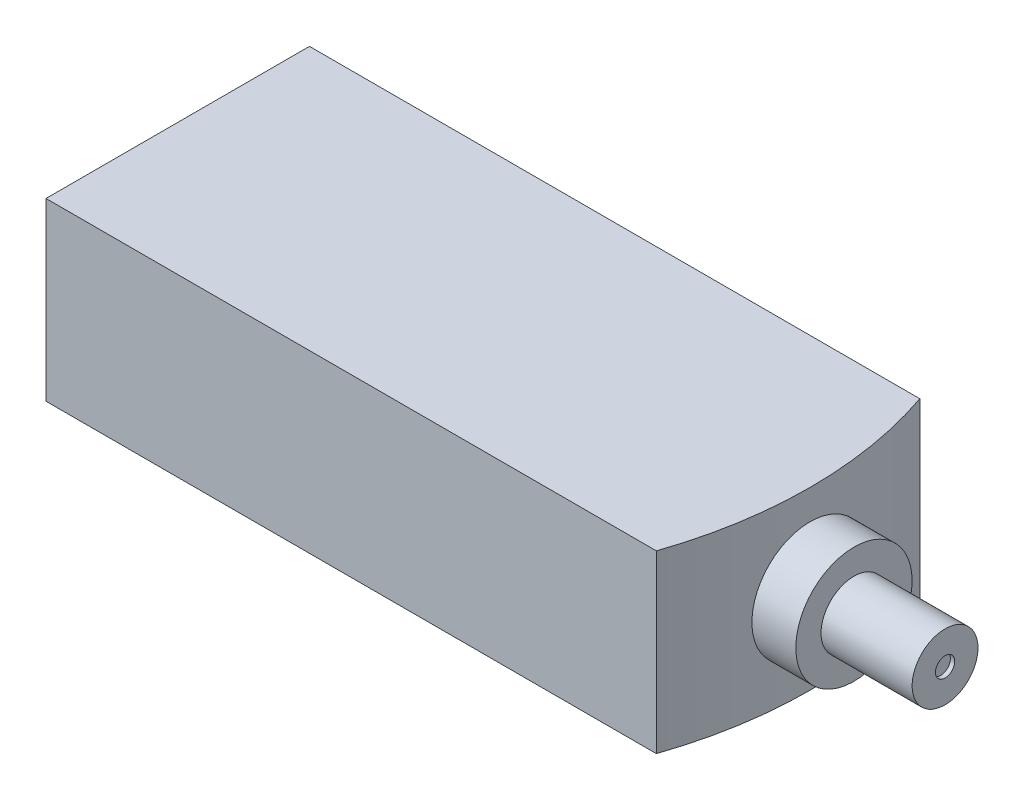
ISO-10303-21;
HEADER;
FILE_DESCRIPTION(('STEP AP214'),'2;1');
FILE_NAME('part.step','',(''),(''),'','','');
FILE_SCHEMA(('AUTOMOTIVE_DESIGN { 1 0 10303 214 1 1 1 1 }'));
ENDSEC;
DATA;
#1=APPLICATION_CONTEXT('core data for automotive mechanical design processes');
#2=APPLICATION_PROTOCOL_DEFINITION('international standard','automotive_design',2000,#1);
#3=PRODUCT_CONTEXT('',#1,'mechanical');
#4=PRODUCT('Part','Part','',(#3));
#5=PRODUCT_RELATED_PRODUCT_CATEGORY('part','',(#4));
#6=PRODUCT_DEFINITION_FORMATION('','',#4);
#7=PRODUCT_DEFINITION_CONTEXT('part definition',#1,'design');
#8=PRODUCT_DEFINITION('design','',#6,#7);
#9=PRODUCT_DEFINITION_SHAPE('','',#8);
#10=(LENGTH_UNIT() NAMED_UNIT(*) SI_UNIT(.MILLI.,.METRE.));
#11=(NAMED_UNIT(*) PLANE_ANGLE_UNIT() SI_UNIT($,.RADIAN.));
#12=(NAMED_UNIT(*) SI_UNIT($,.STERADIAN.) SOLID_ANGLE_UNIT());
#13=UNCERTAINTY_MEASURE_WITH_UNIT(LENGTH_MEASURE(1.E-05),#10,'distance_accuracy_value','');
#14=(GEOMETRIC_REPRESENTATION_CONTEXT(3) GLOBAL_UNCERTAINTY_ASSIGNED_CONTEXT((#13)) GLOBAL_UNIT_ASSIGNED_CONTEXT((#10,
#11,#12)) REPRESENTATION_CONTEXT('',''));
#15=CARTESIAN_POINT('',(0.,0.,0.));
#16=DIRECTION('',(0.,0.,1.));
#17=DIRECTION('',(1.,0.,0.));
#18=AXIS2_PLACEMENT_3D('',#15,#16,#17);
#19=CARTESIAN_POINT('',(53.664660841939,40.,-42.4281648318437));
#20=DIRECTION('',(-1.,0.,0.));
#21=DIRECTION('',(0.,0.,1.));
#22=AXIS2_PLACEMENT_3D('',#19,#20,#21);
#23=CYLINDRICAL_SURFACE('',#22,26.482881767622);
#24=CARTESIAN_POINT('',(53.664660841939,40.,-42.4281648318437));
#25=DIRECTION('',(1.,0.,0.));
#26=DIRECTION('',(0.,0.,-1.));
#27=AXIS2_PLACEMENT_3D('',#24,#25,#26);
#28=CIRCLE('',#27,26.482881767622);
#29=CARTESIAN_POINT('',(53.664660841939,40.,-68.9110465994657));
#30=VERTEX_POINT('',#29);
#31=EDGE_CURVE('E11',#30,#30,#28,.T.);
#32=ORIENTED_EDGE('',*,*,#31,.F.);
#33=EDGE_LOOP('',(#32));
#34=FACE_BOUND('',#33,.T.);
#35=CARTESIAN_POINT('',(33.6646608419389,40.,-42.4281648318437));
#36=DIRECTION('',(1.,0.,0.));
#37=DIRECTION('',(0.,0.,-1.));
#38=AXIS2_PLACEMENT_3D('',#35,#36,#37);
#39=CIRCLE('',#38,26.482881767622);
#40=CARTESIAN_POINT('',(33.6646608419389,40.,-68.9110465994657));
#41=VERTEX_POINT('',#40);
#42=EDGE_CURVE('E44',#41,#41,#39,.T.);
#43=ORIENTED_EDGE('',*,*,#42,.T.);
#44=EDGE_LOOP('',(#43));
#45=FACE_BOUND('',#44,.T.);
#46=ADVANCED_FACE('F41',(#34,#45),#23,.T.);
#47=CARTESIAN_POINT('',(53.664660841939,40.,-42.4281648318437));
#48=DIRECTION('',(1.,0.,0.));
#49=DIRECTION('',(0.,0.,-1.));
#50=AXIS2_PLACEMENT_3D('',#47,#48,#49);
#51=PLANE('',#50);
#52=CARTESIAN_POINT('',(53.664660841939,40.,-42.4281648318437));
#53=DIRECTION('',(1.,0.,0.));
#54=DIRECTION('',(0.,0.,-1.));
#55=AXIS2_PLACEMENT_3D('',#52,#53,#54);
#56=CIRCLE('',#55,15.);
#57=CARTESIAN_POINT('',(53.664660841939,40.,-57.4281648318437));
#58=VERTEX_POINT('',#57);
#59=EDGE_CURVE('E53',#58,#58,#56,.T.);
#60=ORIENTED_EDGE('',*,*,#59,.F.);
#61=EDGE_LOOP('',(#60));
#62=FACE_BOUND('',#61,.T.);
#63=ORIENTED_EDGE('',*,*,#31,.T.);
#64=EDGE_LOOP('',(#63));
#65=FACE_BOUND('',#64,.T.);
#66=ADVANCED_FACE('F86',(#62,#65),#51,.T.);
#67=CARTESIAN_POINT('',(33.6646608419389,40.,-42.4281648318437));
#68=DIRECTION('',(1.,0.,0.));
#69=DIRECTION('',(0.,0.,-1.));
#70=AXIS2_PLACEMENT_3D('',#67,#68,#69);
#71=PLANE('',#70);
#72=ORIENTED_EDGE('',*,*,#42,.F.);
#73=EDGE_LOOP('',(#72));
#74=FACE_BOUND('',#73,.T.);
#75=ADVANCED_FACE('F82',(#74),#71,.F.);
#76=CARTESIAN_POINT('',(95.164660841939,40.,-42.4281648318437));
#77=DIRECTION('',(-1.,0.,0.));
#78=DIRECTION('',(0.,0.,1.));
#79=AXIS2_PLACEMENT_3D('',#76,#77,#78);
#80=CYLINDRICAL_SURFACE('',#79,15.);
#81=CARTESIAN_POINT('',(95.164660841939,40.,-42.4281648318437));
#82=DIRECTION('',(1.,0.,0.));
#83=DIRECTION('',(0.,0.,-1.));
#84=AXIS2_PLACEMENT_3D('',#81,#82,#83);
#85=CIRCLE('',#84,15.);
#86=CARTESIAN_POINT('',(95.164660841939,40.,-57.4281648318437));
#87=VERTEX_POINT('',#86);
#88=EDGE_CURVE('E51',#87,#87,#85,.T.);
#89=ORIENTED_EDGE('',*,*,#88,.F.);
#90=EDGE_LOOP('',(#89));
#91=FACE_BOUND('',#90,.T.);
#92=ORIENTED_EDGE('',*,*,#59,.T.);
#93=EDGE_LOOP('',(#92));
#94=FACE_BOUND('',#93,.T.);
#95=ADVANCED_FACE('F76',(#91,#94),#80,.T.);
#96=CARTESIAN_POINT('',(95.164660841939,40.,-42.4281648318437));
#97=DIRECTION('',(1.,0.,0.));
#98=DIRECTION('',(0.,0.,-1.));
#99=AXIS2_PLACEMENT_3D('',#96,#97,#98);
#100=PLANE('',#99);
#101=CARTESIAN_POINT('',(95.164660841939,40.,-42.4281648318437));
#102=DIRECTION('',(1.,0.,0.));
#103=DIRECTION('',(0.,0.,-1.));
#104=AXIS2_PLACEMENT_3D('',#101,#102,#103);
#105=CIRCLE('',#104,4.40575071218853);
#106=CARTESIAN_POINT('',(95.164660841939,40.,-46.8339155440322));
#107=VERTEX_POINT('',#106);
#108=EDGE_CURVE('E59',#107,#107,#105,.T.);
#109=ORIENTED_EDGE('',*,*,#108,.F.);
#110=EDGE_LOOP('',(#109));
#111=FACE_BOUND('',#110,.T.);
#112=ORIENTED_EDGE('',*,*,#88,.T.);
#113=EDGE_LOOP('',(#112));
#114=FACE_BOUND('',#113,.T.);
#115=ADVANCED_FACE('F70',(#111,#114),#100,.T.);
#116=CARTESIAN_POINT('',(93.1646608419389,40.,-42.4281648318437));
#117=DIRECTION('',(1.,0.,0.));
#118=DIRECTION('',(0.,0.,-1.));
#119=AXIS2_PLACEMENT_3D('',#116,#117,#118);
#120=CYLINDRICAL_SURFACE('',#119,4.40575071218853);
#121=CARTESIAN_POINT('',(93.1646608419389,40.,-42.4281648318437));
#122=DIRECTION('',(1.,0.,0.));
#123=DIRECTION('',(0.,0.,-1.));
#124=AXIS2_PLACEMENT_3D('',#121,#122,#123);
#125=CIRCLE('',#124,4.40575071218853);
#126=CARTESIAN_POINT('',(93.1646608419389,40.,-46.8339155440322));
#127=VERTEX_POINT('',#126);
#128=EDGE_CURVE('E56',#127,#127,#125,.T.);
#129=ORIENTED_EDGE('',*,*,#128,.F.);
#130=EDGE_LOOP('',(#129));
#131=FACE_BOUND('',#130,.T.);
#132=ORIENTED_EDGE('',*,*,#108,.T.);
#133=EDGE_LOOP('',(#132));
#134=FACE_BOUND('',#133,.T.);
#135=ADVANCED_FACE('F67',(#131,#134),#120,.F.);
#136=CARTESIAN_POINT('',(93.1646608419389,40.,-42.4281648318437));
#137=DIRECTION('',(1.,0.,0.));
#138=DIRECTION('',(0.,0.,-1.));
#139=AXIS2_PLACEMENT_3D('',#136,#137,#138);
#140=PLANE('',#139);
#141=ORIENTED_EDGE('',*,*,#128,.T.);
#142=EDGE_LOOP('',(#141));
#143=FACE_BOUND('',#142,.T.);
#144=ADVANCED_FACE('F65',(#143),#140,.T.);
#145=CLOSED_SHELL('',(#46,#66,#75,#95,#115,#135,#144));
#146=MANIFOLD_SOLID_BREP('B2',#145);
#147=CARTESIAN_POINT('',(-254.335339158061,80.,17.5718351681563));
#148=DIRECTION('',(0.,0.,-1.));
#149=DIRECTION('',(-1.,0.,0.));
#150=AXIS2_PLACEMENT_3D('',#147,#148,#149);
#151=PLANE('',#150);
#152=DIRECTION('',(0.,1.,0.));
#153=VECTOR('',#152,1.);
#154=CARTESIAN_POINT('',(23.6646608419389,0.,17.5718351681563));
#155=LINE('',#154,#153);
#156=CARTESIAN_POINT('',(23.6646608419389,0.,17.5718351681563));
#157=VERTEX_POINT('',#156);
#158=CARTESIAN_POINT('',(23.6646608419389,80.,17.5718351681563));
#159=VERTEX_POINT('',#158);
#160=EDGE_CURVE('E156',#157,#159,#155,.T.);
#161=ORIENTED_EDGE('',*,*,#160,.T.);
#162=DIRECTION('',(1.,0.,0.));
#163=VECTOR('',#162,1.);
#164=CARTESIAN_POINT('',(-254.335339158061,80.,17.5718351681563));
#165=LINE('',#164,#163);
#166=CARTESIAN_POINT('',(-254.335339158061,80.,17.5718351681563));
#167=VERTEX_POINT('',#166);
#168=EDGE_CURVE('E206',#167,#159,#165,.T.);
#169=ORIENTED_EDGE('',*,*,#168,.F.);
#170=DIRECTION('',(0.,-1.,0.));
#171=VECTOR('',#170,1.);
#172=CARTESIAN_POINT('',(-254.335339158061,80.,17.5718351681563));
#173=LINE('',#172,#171);
#174=CARTESIAN_POINT('',(-254.335339158061,0.,17.5718351681563));
#175=VERTEX_POINT('',#174);
#176=EDGE_CURVE('E149',#167,#175,#173,.T.);
#177=ORIENTED_EDGE('',*,*,#176,.T.);
#178=DIRECTION('',(1.,0.,0.));
#179=VECTOR('',#178,1.);
#180=CARTESIAN_POINT('',(-254.335339158061,0.,17.5718351681563));
#181=LINE('',#180,#179);
#182=EDGE_CURVE('E189',#175,#157,#181,.T.);
#183=ORIENTED_EDGE('',*,*,#182,.T.);
#184=EDGE_LOOP('',(#161,#169,#177,#183));
#185=FACE_BOUND('',#184,.T.);
#186=ADVANCED_FACE('F141',(#185),#151,.F.);
#187=CARTESIAN_POINT('',(-254.335339158061,80.,-102.428164831844));
#188=DIRECTION('',(0.,0.,1.));
#189=DIRECTION('',(1.,0.,0.));
#190=AXIS2_PLACEMENT_3D('',#187,#188,#189);
#191=PLANE('',#190);
#192=DIRECTION('',(0.,1.,0.));
#193=VECTOR('',#192,1.);
#194=CARTESIAN_POINT('',(23.6646608419389,0.,-102.428164831844));
#195=LINE('',#194,#193);
#196=CARTESIAN_POINT('',(23.6646608419389,0.,-102.428164831844));
#197=VERTEX_POINT('',#196);
#198=CARTESIAN_POINT('',(23.6646608419389,80.,-102.428164831844));
#199=VERTEX_POINT('',#198);
#200=EDGE_CURVE('E185',#197,#199,#195,.T.);
#201=ORIENTED_EDGE('',*,*,#200,.F.);
#202=DIRECTION('',(-1.,0.,0.));
#203=VECTOR('',#202,1.);
#204=CARTESIAN_POINT('',(-254.335339158061,0.,-102.428164831844));
#205=LINE('',#204,#203);
#206=CARTESIAN_POINT('',(-254.335339158061,0.,-102.428164831844));
#207=VERTEX_POINT('',#206);
#208=EDGE_CURVE('E179',#197,#207,#205,.T.);
#209=ORIENTED_EDGE('',*,*,#208,.T.);
#210=DIRECTION('',(0.,-1.,0.));
#211=VECTOR('',#210,1.);
#212=CARTESIAN_POINT('',(-254.335339158061,80.,-102.428164831844));
#213=LINE('',#212,#211);
#214=CARTESIAN_POINT('',(-254.335339158061,80.,-102.428164831844));
#215=VERTEX_POINT('',#214);
#216=EDGE_CURVE('E182',#215,#207,#213,.T.);
#217=ORIENTED_EDGE('',*,*,#216,.F.);
#218=DIRECTION('',(-1.,0.,0.));
#219=VECTOR('',#218,1.);
#220=CARTESIAN_POINT('',(-254.335339158061,80.,-102.428164831844));
#221=LINE('',#220,#219);
#222=EDGE_CURVE('E165',#199,#215,#221,.T.);
#223=ORIENTED_EDGE('',*,*,#222,.F.);
#224=EDGE_LOOP('',(#201,#209,#217,#223));
#225=FACE_BOUND('',#224,.T.);
#226=ADVANCED_FACE('F181',(#225),#191,.F.);
#227=CARTESIAN_POINT('',(0.,80.,0.));
#228=DIRECTION('',(0.,1.,0.));
#229=DIRECTION('',(0.,0.,1.));
#230=AXIS2_PLACEMENT_3D('',#227,#228,#229);
#231=PLANE('',#230);
#232=ORIENTED_EDGE('',*,*,#168,.T.);
#233=CARTESIAN_POINT('',(-151.335339158061,80.,-42.4281648318437));
#234=DIRECTION('',(0.,1.,0.));
#235=DIRECTION('',(0.,0.,1.));
#236=AXIS2_PLACEMENT_3D('',#233,#234,#235);
#237=CIRCLE('',#236,185.);
#238=EDGE_CURVE('E213',#159,#199,#237,.T.);
#239=ORIENTED_EDGE('',*,*,#238,.T.);
#240=ORIENTED_EDGE('',*,*,#222,.T.);
#241=DIRECTION('',(0.,0.,1.));
#242=VECTOR('',#241,1.);
#243=CARTESIAN_POINT('',(-254.335339158061,80.,-102.428164831844));
#244=LINE('',#243,#242);
#245=EDGE_CURVE('E188',#215,#167,#244,.T.);
#246=ORIENTED_EDGE('',*,*,#245,.T.);
#247=EDGE_LOOP('',(#232,#239,#240,#246));
#248=FACE_BOUND('',#247,.T.);
#249=ADVANCED_FACE('F208',(#248),#231,.T.);
#250=CARTESIAN_POINT('',(0.,0.,0.));
#251=DIRECTION('',(0.,1.,0.));
#252=DIRECTION('',(0.,0.,1.));
#253=AXIS2_PLACEMENT_3D('',#250,#251,#252);
#254=PLANE('',#253);
#255=CARTESIAN_POINT('',(-57.3353391580611,0.,-42.4281648318437));
#256=DIRECTION('',(0.,-1.,0.));
#257=DIRECTION('',(0.,0.,-1.));
#258=AXIS2_PLACEMENT_3D('',#255,#256,#257);
#259=CIRCLE('',#258,3.00000000000001);
#260=CARTESIAN_POINT('',(-57.3353391580611,0.,-45.4281648318437));
#261=VERTEX_POINT('',#260);
#262=EDGE_CURVE('E238',#261,#261,#259,.T.);
#263=ORIENTED_EDGE('',*,*,#262,.F.);
#264=EDGE_LOOP('',(#263));
#265=FACE_BOUND('',#264,.T.);
#266=CARTESIAN_POINT('',(-129.835339158061,0.,-42.4281648318437));
#267=DIRECTION('',(0.,-1.,0.));
#268=DIRECTION('',(0.,0.,-1.));
#269=AXIS2_PLACEMENT_3D('',#266,#267,#268);
#270=CIRCLE('',#269,2.);
#271=CARTESIAN_POINT('',(-129.835339158061,0.,-44.4281648318437));
#272=VERTEX_POINT('',#271);
#273=EDGE_CURVE('E232',#272,#272,#270,.T.);
#274=ORIENTED_EDGE('',*,*,#273,.F.);
#275=EDGE_LOOP('',(#274));
#276=FACE_BOUND('',#275,.T.);
#277=CARTESIAN_POINT('',(-69.8353391580611,0.,-42.4281648318437));
#278=DIRECTION('',(0.,-1.,0.));
#279=DIRECTION('',(0.,0.,-1.));
#280=AXIS2_PLACEMENT_3D('',#277,#278,#279);
#281=CIRCLE('',#280,2.);
#282=CARTESIAN_POINT('',(-69.8353391580611,0.,-44.4281648318437));
#283=VERTEX_POINT('',#282);
#284=EDGE_CURVE('E226',#283,#283,#281,.T.);
#285=ORIENTED_EDGE('',*,*,#284,.F.);
#286=EDGE_LOOP('',(#285));
#287=FACE_BOUND('',#286,.T.);
#288=CARTESIAN_POINT('',(-142.335339158061,0.,-42.4281648318437));
#289=DIRECTION('',(0.,-1.,0.));
#290=DIRECTION('',(0.,0.,-1.));
#291=AXIS2_PLACEMENT_3D('',#288,#289,#290);
#292=CIRCLE('',#291,2.99999999999999);
#293=CARTESIAN_POINT('',(-142.335339158061,0.,-45.4281648318437));
#294=VERTEX_POINT('',#293);
#295=EDGE_CURVE('E220',#294,#294,#292,.T.);
#296=ORIENTED_EDGE('',*,*,#295,.F.);
#297=EDGE_LOOP('',(#296));
#298=FACE_BOUND('',#297,.T.);
#299=CARTESIAN_POINT('',(-151.335339158061,0.,-42.4281648318437));
#300=DIRECTION('',(0.,1.,0.));
#301=DIRECTION('',(0.,0.,1.));
#302=AXIS2_PLACEMENT_3D('',#299,#300,#301);
#303=CIRCLE('',#302,185.);
#304=EDGE_CURVE('E212',#157,#197,#303,.T.);
#305=ORIENTED_EDGE('',*,*,#304,.F.);
#306=ORIENTED_EDGE('',*,*,#182,.F.);
#307=DIRECTION('',(0.,0.,1.));
#308=VECTOR('',#307,1.);
#309=CARTESIAN_POINT('',(-254.335339158061,0.,-102.428164831844));
#310=LINE('',#309,#308);
#311=EDGE_CURVE('E194',#207,#175,#310,.T.);
#312=ORIENTED_EDGE('',*,*,#311,.F.);
#313=ORIENTED_EDGE('',*,*,#208,.F.);
#314=EDGE_LOOP('',(#305,#306,#312,#313));
#315=FACE_BOUND('',#314,.T.);
#316=ADVANCED_FACE('F196',(#265,#276,#287,#298,#315),#254,.F.);
#317=CARTESIAN_POINT('',(-254.335339158061,80.,-102.428164831844));
#318=DIRECTION('',(1.,0.,0.));
#319=DIRECTION('',(0.,0.,-1.));
#320=AXIS2_PLACEMENT_3D('',#317,#318,#319);
#321=PLANE('',#320);
#322=CARTESIAN_POINT('',(-254.335339158061,44.6896513789774,-70.8070736871402));
#323=DIRECTION('',(1.,0.,0.));
#324=DIRECTION('',(0.,0.,-1.));
#325=AXIS2_PLACEMENT_3D('',#322,#323,#324);
#326=CIRCLE('',#325,7.50000000000001);
#327=CARTESIAN_POINT('',(-254.335339158061,44.6896513789774,-78.3070736871402));
#328=VERTEX_POINT('',#327);
#329=EDGE_CURVE('E39',#328,#328,#326,.F.);
#330=ORIENTED_EDGE('',*,*,#329,.F.);
#331=EDGE_LOOP('',(#330));
#332=FACE_BOUND('',#331,.T.);
#333=ORIENTED_EDGE('',*,*,#311,.T.);
#334=ORIENTED_EDGE('',*,*,#176,.F.);
#335=ORIENTED_EDGE('',*,*,#245,.F.);
#336=ORIENTED_EDGE('',*,*,#216,.T.);
#337=EDGE_LOOP('',(#333,#334,#335,#336));
#338=FACE_BOUND('',#337,.T.);
#339=ADVANCED_FACE('F143',(#332,#338),#321,.F.);
#340=CARTESIAN_POINT('',(-151.335339158061,0.,-42.4281648318437));
#341=DIRECTION('',(0.,1.,0.));
#342=DIRECTION('',(0.,0.,1.));
#343=AXIS2_PLACEMENT_3D('',#340,#341,#342);
#344=CYLINDRICAL_SURFACE('',#343,185.);
#345=ORIENTED_EDGE('',*,*,#238,.F.);
#346=ORIENTED_EDGE('',*,*,#160,.F.);
#347=ORIENTED_EDGE('',*,*,#304,.T.);
#348=ORIENTED_EDGE('',*,*,#200,.T.);
#349=EDGE_LOOP('',(#345,#346,#347,#348));
#350=FACE_BOUND('',#349,.T.);
#351=ADVANCED_FACE('F287',(#350),#344,.T.);
#352=CARTESIAN_POINT('',(-262.835339158061,44.6896513789774,-70.8070736871402));
#353=DIRECTION('',(1.,0.,0.));
#354=DIRECTION('',(0.,0.,-1.));
#355=AXIS2_PLACEMENT_3D('',#352,#353,#354);
#356=CYLINDRICAL_SURFACE('',#355,7.50000000000001);
#357=CARTESIAN_POINT('',(-262.835339158061,44.6896513789774,-70.8070736871402));
#358=DIRECTION('',(-1.,0.,0.));
#359=DIRECTION('',(0.,0.,1.));
#360=AXIS2_PLACEMENT_3D('',#357,#358,#359);
#361=CIRCLE('',#360,7.50000000000001);
#362=CARTESIAN_POINT('',(-262.835339158061,44.6896513789774,-63.3070736871402));
#363=VERTEX_POINT('',#362);
#364=EDGE_CURVE('E215',#363,#363,#361,.T.);
#365=ORIENTED_EDGE('',*,*,#364,.F.);
#366=EDGE_LOOP('',(#365));
#367=FACE_BOUND('',#366,.T.);
#368=ORIENTED_EDGE('',*,*,#329,.T.);
#369=EDGE_LOOP('',(#368));
#370=FACE_BOUND('',#369,.T.);
#371=ADVANCED_FACE('F275',(#367,#370),#356,.T.);
#372=CARTESIAN_POINT('',(-262.835339158061,44.6896513789774,-70.8070736871402));
#373=DIRECTION('',(-1.,0.,0.));
#374=DIRECTION('',(0.,0.,1.));
#375=AXIS2_PLACEMENT_3D('',#372,#373,#374);
#376=PLANE('',#375);
#377=ORIENTED_EDGE('',*,*,#364,.T.);
#378=EDGE_LOOP('',(#377));
#379=FACE_BOUND('',#378,.T.);
#380=ADVANCED_FACE('F265',(#379),#376,.T.);
#381=CARTESIAN_POINT('',(-142.335339158061,10.,-42.4281648318437));
#382=DIRECTION('',(0.,-1.,0.));
#383=DIRECTION('',(0.,0.,-1.));
#384=AXIS2_PLACEMENT_3D('',#381,#382,#383);
#385=CYLINDRICAL_SURFACE('',#384,2.99999999999999);
#386=CARTESIAN_POINT('',(-142.335339158061,10.,-42.4281648318437));
#387=DIRECTION('',(0.,-1.,0.));
#388=DIRECTION('',(0.,0.,-1.));
#389=AXIS2_PLACEMENT_3D('',#386,#387,#388);
#390=CIRCLE('',#389,2.99999999999999);
#391=CARTESIAN_POINT('',(-142.335339158061,10.,-45.4281648318437));
#392=VERTEX_POINT('',#391);
#393=EDGE_CURVE('E219',#392,#392,#390,.T.);
#394=ORIENTED_EDGE('',*,*,#393,.F.);
#395=EDGE_LOOP('',(#394));
#396=FACE_BOUND('',#395,.T.);
#397=ORIENTED_EDGE('',*,*,#295,.T.);
#398=EDGE_LOOP('',(#397));
#399=FACE_BOUND('',#398,.T.);
#400=ADVANCED_FACE('F262',(#396,#399),#385,.F.);
#401=CARTESIAN_POINT('',(-142.335339158061,10.,-42.4281648318437));
#402=DIRECTION('',(0.,-1.,0.));
#403=DIRECTION('',(0.,0.,-1.));
#404=AXIS2_PLACEMENT_3D('',#401,#402,#403);
#405=PLANE('',#404);
#406=ORIENTED_EDGE('',*,*,#393,.T.);
#407=EDGE_LOOP('',(#406));
#408=FACE_BOUND('',#407,.T.);
#409=ADVANCED_FACE('F264',(#408),#405,.T.);
#410=CARTESIAN_POINT('',(-69.8353391580611,10.,-42.4281648318437));
#411=DIRECTION('',(0.,-1.,0.));
#412=DIRECTION('',(0.,0.,-1.));
#413=AXIS2_PLACEMENT_3D('',#410,#411,#412);
#414=CYLINDRICAL_SURFACE('',#413,2.);
#415=CARTESIAN_POINT('',(-69.8353391580611,10.,-42.4281648318437));
#416=DIRECTION('',(0.,-1.,0.));
#417=DIRECTION('',(0.,0.,-1.));
#418=AXIS2_PLACEMENT_3D('',#415,#416,#417);
#419=CIRCLE('',#418,2.);
#420=CARTESIAN_POINT('',(-69.8353391580611,10.,-44.4281648318437));
#421=VERTEX_POINT('',#420);
#422=EDGE_CURVE('E229',#421,#421,#419,.T.);
#423=ORIENTED_EDGE('',*,*,#422,.F.);
#424=EDGE_LOOP('',(#423));
#425=FACE_BOUND('',#424,.T.);
#426=ORIENTED_EDGE('',*,*,#284,.T.);
#427=EDGE_LOOP('',(#426));
#428=FACE_BOUND('',#427,.T.);
#429=ADVANCED_FACE('F272',(#425,#428),#414,.F.);
#430=CARTESIAN_POINT('',(-69.8353391580611,10.,-42.4281648318437));
#431=DIRECTION('',(0.,-1.,0.));
#432=DIRECTION('',(0.,0.,-1.));
#433=AXIS2_PLACEMENT_3D('',#430,#431,#432);
#434=PLANE('',#433);
#435=ORIENTED_EDGE('',*,*,#422,.T.);
#436=EDGE_LOOP('',(#435));
#437=FACE_BOUND('',#436,.T.);
#438=ADVANCED_FACE('F352',(#437),#434,.T.);
#439=CARTESIAN_POINT('',(-129.835339158061,10.,-42.4281648318437));
#440=DIRECTION('',(0.,-1.,0.));
#441=DIRECTION('',(0.,0.,-1.));
#442=AXIS2_PLACEMENT_3D('',#439,#440,#441);
#443=CYLINDRICAL_SURFACE('',#442,2.);
#444=CARTESIAN_POINT('',(-129.835339158061,10.,-42.4281648318437));
#445=DIRECTION('',(0.,-1.,0.));
#446=DIRECTION('',(0.,0.,-1.));
#447=AXIS2_PLACEMENT_3D('',#444,#445,#446);
#448=CIRCLE('',#447,2.);
#449=CARTESIAN_POINT('',(-129.835339158061,10.,-44.4281648318437));
#450=VERTEX_POINT('',#449);
#451=EDGE_CURVE('E235',#450,#450,#448,.T.);
#452=ORIENTED_EDGE('',*,*,#451,.F.);
#453=EDGE_LOOP('',(#452));
#454=FACE_BOUND('',#453,.T.);
#455=ORIENTED_EDGE('',*,*,#273,.T.);
#456=EDGE_LOOP('',(#455));
#457=FACE_BOUND('',#456,.T.);
#458=ADVANCED_FACE('F362',(#454,#457),#443,.F.);
#459=CARTESIAN_POINT('',(-129.835339158061,10.,-42.4281648318437));
#460=DIRECTION('',(0.,-1.,0.));
#461=DIRECTION('',(0.,0.,-1.));
#462=AXIS2_PLACEMENT_3D('',#459,#460,#461);
#463=PLANE('',#462);
#464=ORIENTED_EDGE('',*,*,#451,.T.);
#465=EDGE_LOOP('',(#464));
#466=FACE_BOUND('',#465,.T.);
#467=ADVANCED_FACE('F249',(#466),#463,.T.);
#468=CARTESIAN_POINT('',(-57.3353391580611,10.,-42.4281648318437));
#469=DIRECTION('',(0.,-1.,0.));
#470=DIRECTION('',(0.,0.,-1.));
#471=AXIS2_PLACEMENT_3D('',#468,#469,#470);
#472=CYLINDRICAL_SURFACE('',#471,3.00000000000001);
#473=CARTESIAN_POINT('',(-57.3353391580611,10.,-42.4281648318437));
#474=DIRECTION('',(0.,-1.,0.));
#475=DIRECTION('',(0.,0.,-1.));
#476=AXIS2_PLACEMENT_3D('',#473,#474,#475);
#477=CIRCLE('',#476,3.00000000000001);
#478=CARTESIAN_POINT('',(-57.3353391580611,10.,-45.4281648318437));
#479=VERTEX_POINT('',#478);
#480=EDGE_CURVE('E223',#479,#479,#477,.T.);
#481=ORIENTED_EDGE('',*,*,#480,.F.);
#482=EDGE_LOOP('',(#481));
#483=FACE_BOUND('',#482,.T.);
#484=ORIENTED_EDGE('',*,*,#262,.T.);
#485=EDGE_LOOP('',(#484));
#486=FACE_BOUND('',#485,.T.);
#487=ADVANCED_FACE('F246',(#483,#486),#472,.F.);
#488=CARTESIAN_POINT('',(-57.3353391580611,10.,-42.4281648318437));
#489=DIRECTION('',(0.,-1.,0.));
#490=DIRECTION('',(0.,0.,-1.));
#491=AXIS2_PLACEMENT_3D('',#488,#489,#490);
#492=PLANE('',#491);
#493=ORIENTED_EDGE('',*,*,#480,.T.);
#494=EDGE_LOOP('',(#493));
#495=FACE_BOUND('',#494,.T.);
#496=ADVANCED_FACE('F244',(#495),#492,.T.);
#497=CLOSED_SHELL('',(#186,#226,#249,#316,#339,#351,#371,#380,#400,#409,#429,#438,#458,#467,
#487,#496));
#498=MANIFOLD_SOLID_BREP('B6',#497);
#499=ADVANCED_BREP_SHAPE_REPRESENTATION('',(#18,#146,#498),#14);
#500=SHAPE_DEFINITION_REPRESENTATION(#9,#499);
ENDSEC;
END-ISO-10303-21;
